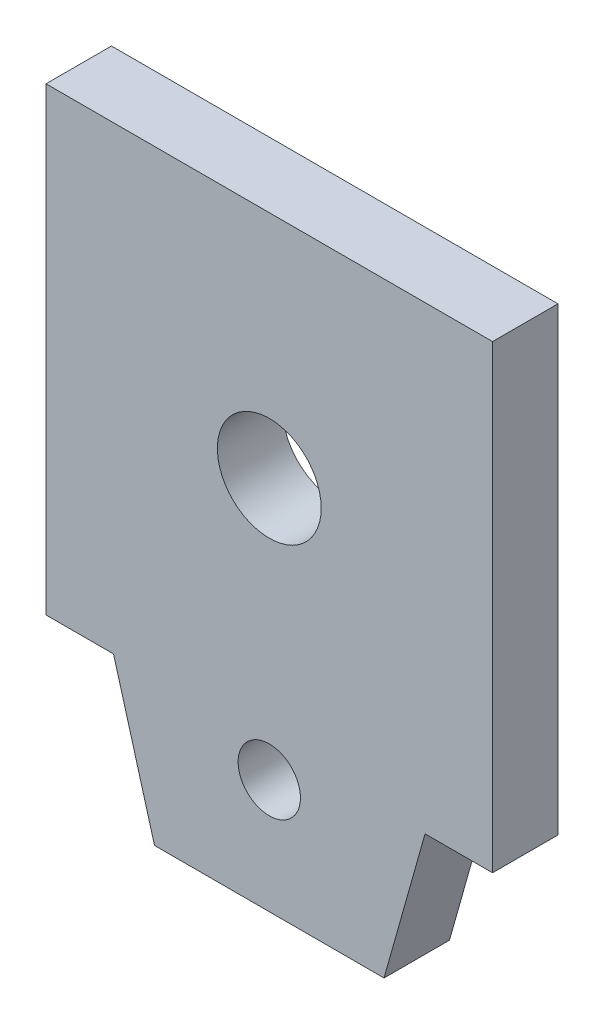
ISO-10303-21;
HEADER;
FILE_DESCRIPTION(('STEP AP214'),'2;1');
FILE_NAME('part.step','',(''),(''),'','','');
FILE_SCHEMA(('AUTOMOTIVE_DESIGN { 1 0 10303 214 1 1 1 1 }'));
ENDSEC;
DATA;
#1=APPLICATION_CONTEXT('core data for automotive mechanical design processes');
#2=APPLICATION_PROTOCOL_DEFINITION('international standard','automotive_design',2000,#1);
#3=PRODUCT_CONTEXT('',#1,'mechanical');
#4=PRODUCT('Part','Part','',(#3));
#5=PRODUCT_RELATED_PRODUCT_CATEGORY('part','',(#4));
#6=PRODUCT_DEFINITION_FORMATION('','',#4);
#7=PRODUCT_DEFINITION_CONTEXT('part definition',#1,'design');
#8=PRODUCT_DEFINITION('design','',#6,#7);
#9=PRODUCT_DEFINITION_SHAPE('','',#8);
#10=(LENGTH_UNIT() NAMED_UNIT(*) SI_UNIT(.MILLI.,.METRE.));
#11=(NAMED_UNIT(*) PLANE_ANGLE_UNIT() SI_UNIT($,.RADIAN.));
#12=(NAMED_UNIT(*) SI_UNIT($,.STERADIAN.) SOLID_ANGLE_UNIT());
#13=UNCERTAINTY_MEASURE_WITH_UNIT(LENGTH_MEASURE(1.E-05),#10,'distance_accuracy_value','');
#14=(GEOMETRIC_REPRESENTATION_CONTEXT(3) GLOBAL_UNCERTAINTY_ASSIGNED_CONTEXT((#13)) GLOBAL_UNIT_ASSIGNED_CONTEXT((#10,
#11,#12)) REPRESENTATION_CONTEXT('',''));
#15=CARTESIAN_POINT('',(0.,0.,0.));
#16=DIRECTION('',(0.,0.,1.));
#17=DIRECTION('',(1.,0.,0.));
#18=AXIS2_PLACEMENT_3D('',#15,#16,#17);
#19=CARTESIAN_POINT('',(0.,0.,3.15));
#20=DIRECTION('',(0.,0.,-1.));
#21=DIRECTION('',(-1.,0.,0.));
#22=AXIS2_PLACEMENT_3D('',#19,#20,#21);
#23=PLANE('',#22);
#24=CARTESIAN_POINT('',(10.75,11.075,3.15));
#25=DIRECTION('',(0.,0.,1.));
#26=DIRECTION('',(1.,0.,0.));
#27=AXIS2_PLACEMENT_3D('',#24,#25,#26);
#28=CIRCLE('',#27,2.5);
#29=CARTESIAN_POINT('',(13.25,11.075,3.15));
#30=VERTEX_POINT('',#29);
#31=EDGE_CURVE('E133',#30,#30,#28,.T.);
#32=ORIENTED_EDGE('',*,*,#31,.F.);
#33=EDGE_LOOP('',(#32));
#34=FACE_BOUND('',#33,.T.);
#35=DIRECTION('',(0.,-1.,0.));
#36=VECTOR('',#35,1.);
#37=CARTESIAN_POINT('',(0.,0.,3.15));
#38=LINE('',#37,#36);
#39=CARTESIAN_POINT('',(0.,22.15,3.15));
#40=VERTEX_POINT('',#39);
#41=CARTESIAN_POINT('',(0.,0.,3.15));
#42=VERTEX_POINT('',#41);
#43=EDGE_CURVE('E144',#40,#42,#38,.T.);
#44=ORIENTED_EDGE('',*,*,#43,.T.);
#45=DIRECTION('',(1.,0.,0.));
#46=VECTOR('',#45,1.);
#47=CARTESIAN_POINT('',(0.,0.,3.15));
#48=LINE('',#47,#46);
#49=CARTESIAN_POINT('',(3.25,0.,3.15));
#50=VERTEX_POINT('',#49);
#51=EDGE_CURVE('E92',#42,#50,#48,.T.);
#52=ORIENTED_EDGE('',*,*,#51,.T.);
#53=DIRECTION('',(0.271541803681509,-0.96242664595978,0.));
#54=VECTOR('',#53,1.);
#55=CARTESIAN_POINT('',(3.25,0.,3.15));
#56=LINE('',#55,#54);
#57=CARTESIAN_POINT('',(5.225,-7.,3.15));
#58=VERTEX_POINT('',#57);
#59=EDGE_CURVE('E159',#50,#58,#56,.T.);
#60=ORIENTED_EDGE('',*,*,#59,.T.);
#61=DIRECTION('',(1.,0.,0.));
#62=VECTOR('',#61,1.);
#63=CARTESIAN_POINT('',(5.225,-7.,3.15));
#64=LINE('',#63,#62);
#65=CARTESIAN_POINT('',(16.275,-7.,3.15));
#66=VERTEX_POINT('',#65);
#67=EDGE_CURVE('E172',#58,#66,#64,.T.);
#68=ORIENTED_EDGE('',*,*,#67,.T.);
#69=DIRECTION('',(0.27154180368151,0.96242664595978,0.));
#70=VECTOR('',#69,1.);
#71=CARTESIAN_POINT('',(18.25,0.,3.15));
#72=LINE('',#71,#70);
#73=CARTESIAN_POINT('',(18.25,0.,3.15));
#74=VERTEX_POINT('',#73);
#75=EDGE_CURVE('E111',#66,#74,#72,.T.);
#76=ORIENTED_EDGE('',*,*,#75,.T.);
#77=DIRECTION('',(1.,0.,0.));
#78=VECTOR('',#77,1.);
#79=CARTESIAN_POINT('',(18.25,0.,3.15));
#80=LINE('',#79,#78);
#81=CARTESIAN_POINT('',(21.5,0.,3.15));
#82=VERTEX_POINT('',#81);
#83=EDGE_CURVE('E105',#74,#82,#80,.T.);
#84=ORIENTED_EDGE('',*,*,#83,.T.);
#85=DIRECTION('',(0.,1.,0.));
#86=VECTOR('',#85,1.);
#87=CARTESIAN_POINT('',(21.5,0.,3.15));
#88=LINE('',#87,#86);
#89=CARTESIAN_POINT('',(21.5,22.15,3.15));
#90=VERTEX_POINT('',#89);
#91=EDGE_CURVE('E109',#82,#90,#88,.T.);
#92=ORIENTED_EDGE('',*,*,#91,.T.);
#93=DIRECTION('',(-1.,0.,0.));
#94=VECTOR('',#93,1.);
#95=CARTESIAN_POINT('',(0.,22.15,3.15));
#96=LINE('',#95,#94);
#97=EDGE_CURVE('E49',#90,#40,#96,.T.);
#98=ORIENTED_EDGE('',*,*,#97,.T.);
#99=EDGE_LOOP('',(#44,#52,#60,#68,#76,#84,#92,#98));
#100=FACE_BOUND('',#99,.T.);
#101=CARTESIAN_POINT('',(10.75,-1.5,3.15));
#102=DIRECTION('',(0.,0.,1.));
#103=DIRECTION('',(1.,0.,0.));
#104=AXIS2_PLACEMENT_3D('',#101,#102,#103);
#105=CIRCLE('',#104,1.5);
#106=CARTESIAN_POINT('',(12.25,-1.5,3.15));
#107=VERTEX_POINT('',#106);
#108=EDGE_CURVE('E181',#107,#107,#105,.T.);
#109=ORIENTED_EDGE('',*,*,#108,.F.);
#110=EDGE_LOOP('',(#109));
#111=FACE_BOUND('',#110,.T.);
#112=ADVANCED_FACE('F32',(#34,#100,#111),#23,.F.);
#113=CARTESIAN_POINT('',(0.,0.,0.));
#114=DIRECTION('',(0.,0.,-1.));
#115=DIRECTION('',(-1.,0.,0.));
#116=AXIS2_PLACEMENT_3D('',#113,#114,#115);
#117=PLANE('',#116);
#118=CARTESIAN_POINT('',(10.75,11.075,0.));
#119=DIRECTION('',(0.,0.,1.));
#120=DIRECTION('',(1.,0.,0.));
#121=AXIS2_PLACEMENT_3D('',#118,#119,#120);
#122=CIRCLE('',#121,2.5);
#123=CARTESIAN_POINT('',(13.25,11.075,0.));
#124=VERTEX_POINT('',#123);
#125=EDGE_CURVE('E178',#124,#124,#122,.T.);
#126=ORIENTED_EDGE('',*,*,#125,.T.);
#127=EDGE_LOOP('',(#126));
#128=FACE_BOUND('',#127,.T.);
#129=DIRECTION('',(0.,-1.,0.));
#130=VECTOR('',#129,1.);
#131=CARTESIAN_POINT('',(0.,0.,0.));
#132=LINE('',#131,#130);
#133=CARTESIAN_POINT('',(0.,22.15,0.));
#134=VERTEX_POINT('',#133);
#135=CARTESIAN_POINT('',(0.,0.,0.));
#136=VERTEX_POINT('',#135);
#137=EDGE_CURVE('E129',#134,#136,#132,.T.);
#138=ORIENTED_EDGE('',*,*,#137,.F.);
#139=DIRECTION('',(-1.,0.,0.));
#140=VECTOR('',#139,1.);
#141=CARTESIAN_POINT('',(0.,22.15,0.));
#142=LINE('',#141,#140);
#143=CARTESIAN_POINT('',(21.5,22.15,0.));
#144=VERTEX_POINT('',#143);
#145=EDGE_CURVE('E84',#144,#134,#142,.T.);
#146=ORIENTED_EDGE('',*,*,#145,.F.);
#147=DIRECTION('',(0.,1.,0.));
#148=VECTOR('',#147,1.);
#149=CARTESIAN_POINT('',(21.5,0.,0.));
#150=LINE('',#149,#148);
#151=CARTESIAN_POINT('',(21.5,0.,0.));
#152=VERTEX_POINT('',#151);
#153=EDGE_CURVE('E78',#152,#144,#150,.T.);
#154=ORIENTED_EDGE('',*,*,#153,.F.);
#155=DIRECTION('',(1.,0.,0.));
#156=VECTOR('',#155,1.);
#157=CARTESIAN_POINT('',(18.25,0.,0.));
#158=LINE('',#157,#156);
#159=CARTESIAN_POINT('',(18.25,0.,0.));
#160=VERTEX_POINT('',#159);
#161=EDGE_CURVE('E119',#160,#152,#158,.T.);
#162=ORIENTED_EDGE('',*,*,#161,.F.);
#163=DIRECTION('',(0.27154180368151,0.96242664595978,0.));
#164=VECTOR('',#163,1.);
#165=CARTESIAN_POINT('',(18.25,0.,0.));
#166=LINE('',#165,#164);
#167=CARTESIAN_POINT('',(16.275,-7.,0.));
#168=VERTEX_POINT('',#167);
#169=EDGE_CURVE('E139',#168,#160,#166,.T.);
#170=ORIENTED_EDGE('',*,*,#169,.F.);
#171=DIRECTION('',(1.,0.,0.));
#172=VECTOR('',#171,1.);
#173=CARTESIAN_POINT('',(5.225,-7.,0.));
#174=LINE('',#173,#172);
#175=CARTESIAN_POINT('',(5.225,-7.,0.));
#176=VERTEX_POINT('',#175);
#177=EDGE_CURVE('E137',#176,#168,#174,.T.);
#178=ORIENTED_EDGE('',*,*,#177,.F.);
#179=DIRECTION('',(0.271541803681509,-0.96242664595978,0.));
#180=VECTOR('',#179,1.);
#181=CARTESIAN_POINT('',(3.25,0.,0.));
#182=LINE('',#181,#180);
#183=CARTESIAN_POINT('',(3.25,0.,0.));
#184=VERTEX_POINT('',#183);
#185=EDGE_CURVE('E135',#184,#176,#182,.T.);
#186=ORIENTED_EDGE('',*,*,#185,.F.);
#187=DIRECTION('',(1.,0.,0.));
#188=VECTOR('',#187,1.);
#189=CARTESIAN_POINT('',(0.,0.,0.));
#190=LINE('',#189,#188);
#191=EDGE_CURVE('E132',#136,#184,#190,.T.);
#192=ORIENTED_EDGE('',*,*,#191,.F.);
#193=EDGE_LOOP('',(#138,#146,#154,#162,#170,#178,#186,#192));
#194=FACE_BOUND('',#193,.T.);
#195=CARTESIAN_POINT('',(10.75,-1.5,0.));
#196=DIRECTION('',(0.,0.,1.));
#197=DIRECTION('',(1.,0.,0.));
#198=AXIS2_PLACEMENT_3D('',#195,#196,#197);
#199=CIRCLE('',#198,1.5);
#200=CARTESIAN_POINT('',(12.25,-1.5,0.));
#201=VERTEX_POINT('',#200);
#202=EDGE_CURVE('E184',#201,#201,#199,.T.);
#203=ORIENTED_EDGE('',*,*,#202,.T.);
#204=EDGE_LOOP('',(#203));
#205=FACE_BOUND('',#204,.T.);
#206=ADVANCED_FACE('F163',(#128,#194,#205),#117,.T.);
#207=CARTESIAN_POINT('',(0.,0.,3.15));
#208=DIRECTION('',(1.,0.,0.));
#209=DIRECTION('',(0.,0.,-1.));
#210=AXIS2_PLACEMENT_3D('',#207,#208,#209);
#211=PLANE('',#210);
#212=ORIENTED_EDGE('',*,*,#137,.T.);
#213=DIRECTION('',(0.,0.,-1.));
#214=VECTOR('',#213,1.);
#215=CARTESIAN_POINT('',(0.,0.,3.15));
#216=LINE('',#215,#214);
#217=EDGE_CURVE('E11',#42,#136,#216,.T.);
#218=ORIENTED_EDGE('',*,*,#217,.F.);
#219=ORIENTED_EDGE('',*,*,#43,.F.);
#220=DIRECTION('',(0.,0.,-1.));
#221=VECTOR('',#220,1.);
#222=CARTESIAN_POINT('',(0.,22.15,3.15));
#223=LINE('',#222,#221);
#224=EDGE_CURVE('E125',#40,#134,#223,.T.);
#225=ORIENTED_EDGE('',*,*,#224,.T.);
#226=EDGE_LOOP('',(#212,#218,#219,#225));
#227=FACE_BOUND('',#226,.T.);
#228=ADVANCED_FACE('F34',(#227),#211,.F.);
#229=CARTESIAN_POINT('',(0.,0.,3.15));
#230=DIRECTION('',(0.,1.,0.));
#231=DIRECTION('',(0.,0.,1.));
#232=AXIS2_PLACEMENT_3D('',#229,#230,#231);
#233=PLANE('',#232);
#234=ORIENTED_EDGE('',*,*,#191,.T.);
#235=DIRECTION('',(0.,0.,-1.));
#236=VECTOR('',#235,1.);
#237=CARTESIAN_POINT('',(3.25,0.,3.15));
#238=LINE('',#237,#236);
#239=EDGE_CURVE('E41',#50,#184,#238,.T.);
#240=ORIENTED_EDGE('',*,*,#239,.F.);
#241=ORIENTED_EDGE('',*,*,#51,.F.);
#242=ORIENTED_EDGE('',*,*,#217,.T.);
#243=EDGE_LOOP('',(#234,#240,#241,#242));
#244=FACE_BOUND('',#243,.T.);
#245=ADVANCED_FACE('F217',(#244),#233,.F.);
#246=CARTESIAN_POINT('',(3.25,0.,3.15));
#247=DIRECTION('',(0.962426645959781,0.271541803681509,0.));
#248=DIRECTION('',(-0.271541803681509,0.96242664595978,0.));
#249=AXIS2_PLACEMENT_3D('',#246,#247,#248);
#250=PLANE('',#249);
#251=ORIENTED_EDGE('',*,*,#185,.T.);
#252=DIRECTION('',(0.,0.,-1.));
#253=VECTOR('',#252,1.);
#254=CARTESIAN_POINT('',(5.225,-7.,3.15));
#255=LINE('',#254,#253);
#256=EDGE_CURVE('E151',#58,#176,#255,.T.);
#257=ORIENTED_EDGE('',*,*,#256,.F.);
#258=ORIENTED_EDGE('',*,*,#59,.F.);
#259=ORIENTED_EDGE('',*,*,#239,.T.);
#260=EDGE_LOOP('',(#251,#257,#258,#259));
#261=FACE_BOUND('',#260,.T.);
#262=ADVANCED_FACE('F157',(#261),#250,.F.);
#263=CARTESIAN_POINT('',(5.225,-7.,3.15));
#264=DIRECTION('',(0.,1.,0.));
#265=DIRECTION('',(0.,0.,1.));
#266=AXIS2_PLACEMENT_3D('',#263,#264,#265);
#267=PLANE('',#266);
#268=ORIENTED_EDGE('',*,*,#177,.T.);
#269=DIRECTION('',(0.,0.,-1.));
#270=VECTOR('',#269,1.);
#271=CARTESIAN_POINT('',(16.275,-7.,3.15));
#272=LINE('',#271,#270);
#273=EDGE_CURVE('E148',#66,#168,#272,.T.);
#274=ORIENTED_EDGE('',*,*,#273,.F.);
#275=ORIENTED_EDGE('',*,*,#67,.F.);
#276=ORIENTED_EDGE('',*,*,#256,.T.);
#277=EDGE_LOOP('',(#268,#274,#275,#276));
#278=FACE_BOUND('',#277,.T.);
#279=ADVANCED_FACE('F168',(#278),#267,.F.);
#280=CARTESIAN_POINT('',(18.25,0.,3.15));
#281=DIRECTION('',(-0.96242664595978,0.27154180368151,0.));
#282=DIRECTION('',(-0.27154180368151,-0.96242664595978,0.));
#283=AXIS2_PLACEMENT_3D('',#280,#281,#282);
#284=PLANE('',#283);
#285=ORIENTED_EDGE('',*,*,#169,.T.);
#286=DIRECTION('',(0.,0.,-1.));
#287=VECTOR('',#286,1.);
#288=CARTESIAN_POINT('',(18.25,0.,3.15));
#289=LINE('',#288,#287);
#290=EDGE_CURVE('E120',#74,#160,#289,.T.);
#291=ORIENTED_EDGE('',*,*,#290,.F.);
#292=ORIENTED_EDGE('',*,*,#75,.F.);
#293=ORIENTED_EDGE('',*,*,#273,.T.);
#294=EDGE_LOOP('',(#285,#291,#292,#293));
#295=FACE_BOUND('',#294,.T.);
#296=ADVANCED_FACE('F171',(#295),#284,.F.);
#297=CARTESIAN_POINT('',(18.25,0.,3.15));
#298=DIRECTION('',(0.,1.,0.));
#299=DIRECTION('',(0.,0.,1.));
#300=AXIS2_PLACEMENT_3D('',#297,#298,#299);
#301=PLANE('',#300);
#302=ORIENTED_EDGE('',*,*,#161,.T.);
#303=DIRECTION('',(0.,0.,-1.));
#304=VECTOR('',#303,1.);
#305=CARTESIAN_POINT('',(21.5,0.,3.15));
#306=LINE('',#305,#304);
#307=EDGE_CURVE('E116',#82,#152,#306,.T.);
#308=ORIENTED_EDGE('',*,*,#307,.F.);
#309=ORIENTED_EDGE('',*,*,#83,.F.);
#310=ORIENTED_EDGE('',*,*,#290,.T.);
#311=EDGE_LOOP('',(#302,#308,#309,#310));
#312=FACE_BOUND('',#311,.T.);
#313=ADVANCED_FACE('F117',(#312),#301,.F.);
#314=CARTESIAN_POINT('',(21.5,0.,3.15));
#315=DIRECTION('',(-1.,0.,0.));
#316=DIRECTION('',(0.,0.,1.));
#317=AXIS2_PLACEMENT_3D('',#314,#315,#316);
#318=PLANE('',#317);
#319=ORIENTED_EDGE('',*,*,#153,.T.);
#320=DIRECTION('',(0.,0.,-1.));
#321=VECTOR('',#320,1.);
#322=CARTESIAN_POINT('',(21.5,22.15,3.15));
#323=LINE('',#322,#321);
#324=EDGE_CURVE('E121',#90,#144,#323,.T.);
#325=ORIENTED_EDGE('',*,*,#324,.F.);
#326=ORIENTED_EDGE('',*,*,#91,.F.);
#327=ORIENTED_EDGE('',*,*,#307,.T.);
#328=EDGE_LOOP('',(#319,#325,#326,#327));
#329=FACE_BOUND('',#328,.T.);
#330=ADVANCED_FACE('F123',(#329),#318,.F.);
#331=CARTESIAN_POINT('',(0.,22.15,3.15));
#332=DIRECTION('',(0.,-1.,0.));
#333=DIRECTION('',(0.,0.,-1.));
#334=AXIS2_PLACEMENT_3D('',#331,#332,#333);
#335=PLANE('',#334);
#336=ORIENTED_EDGE('',*,*,#145,.T.);
#337=ORIENTED_EDGE('',*,*,#224,.F.);
#338=ORIENTED_EDGE('',*,*,#97,.F.);
#339=ORIENTED_EDGE('',*,*,#324,.T.);
#340=EDGE_LOOP('',(#336,#337,#338,#339));
#341=FACE_BOUND('',#340,.T.);
#342=ADVANCED_FACE('F205',(#341),#335,.F.);
#343=CARTESIAN_POINT('',(10.75,11.075,3.15));
#344=DIRECTION('',(0.,0.,-1.));
#345=DIRECTION('',(-1.,0.,0.));
#346=AXIS2_PLACEMENT_3D('',#343,#344,#345);
#347=CYLINDRICAL_SURFACE('',#346,2.5);
#348=ORIENTED_EDGE('',*,*,#31,.T.);
#349=EDGE_LOOP('',(#348));
#350=FACE_BOUND('',#349,.T.);
#351=ORIENTED_EDGE('',*,*,#125,.F.);
#352=EDGE_LOOP('',(#351));
#353=FACE_BOUND('',#352,.T.);
#354=ADVANCED_FACE('F202',(#350,#353),#347,.F.);
#355=CARTESIAN_POINT('',(10.75,-1.5,3.15));
#356=DIRECTION('',(0.,0.,-1.));
#357=DIRECTION('',(-1.,0.,0.));
#358=AXIS2_PLACEMENT_3D('',#355,#356,#357);
#359=CYLINDRICAL_SURFACE('',#358,1.5);
#360=ORIENTED_EDGE('',*,*,#108,.T.);
#361=EDGE_LOOP('',(#360));
#362=FACE_BOUND('',#361,.T.);
#363=ORIENTED_EDGE('',*,*,#202,.F.);
#364=EDGE_LOOP('',(#363));
#365=FACE_BOUND('',#364,.T.);
#366=ADVANCED_FACE('F190',(#362,#365),#359,.F.);
#367=CLOSED_SHELL('',(#112,#206,#228,#245,#262,#279,#296,#313,#330,#342,#354,#366));
#368=MANIFOLD_SOLID_BREP('B2',#367);
#369=ADVANCED_BREP_SHAPE_REPRESENTATION('',(#18,#368),#14);
#370=SHAPE_DEFINITION_REPRESENTATION(#9,#369);
ENDSEC;
END-ISO-10303-21;
